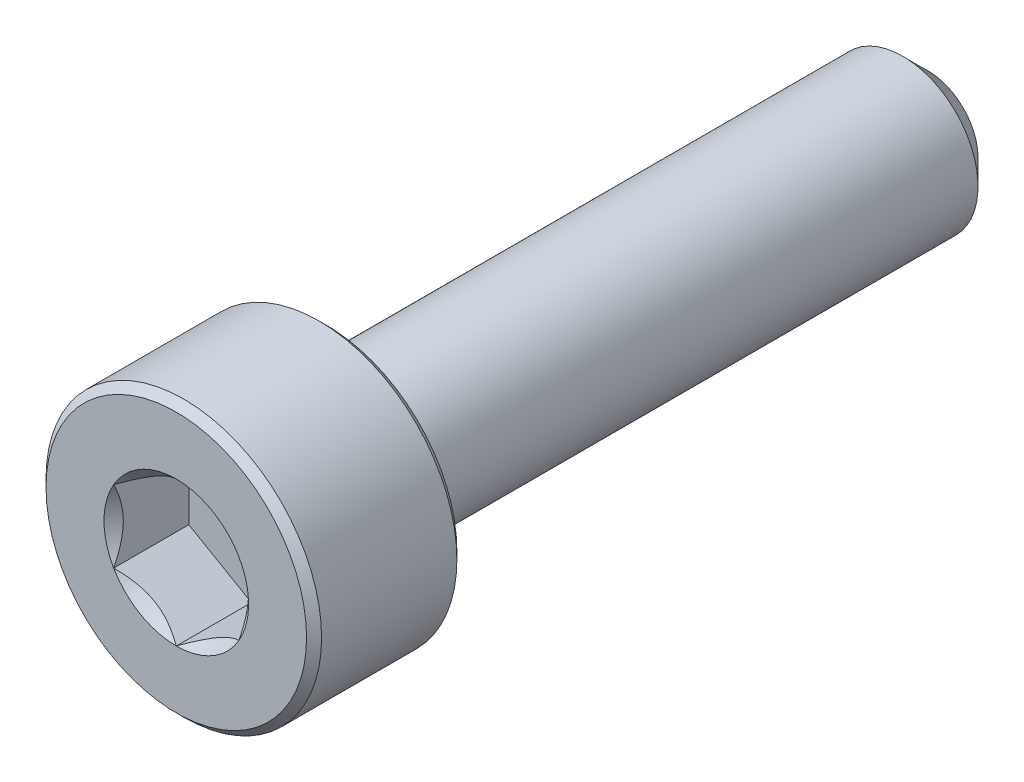
ISO-10303-21;
HEADER;
FILE_DESCRIPTION(('STEP AP214'),'2;1');
FILE_NAME('part.step','',(''),(''),'','','');
FILE_SCHEMA(('AUTOMOTIVE_DESIGN { 1 0 10303 214 1 1 1 1 }'));
ENDSEC;
DATA;
#1=APPLICATION_CONTEXT('core data for automotive mechanical design processes');
#2=APPLICATION_PROTOCOL_DEFINITION('international standard','automotive_design',2000,#1);
#3=PRODUCT_CONTEXT('',#1,'mechanical');
#4=PRODUCT('Part','Part','',(#3));
#5=PRODUCT_RELATED_PRODUCT_CATEGORY('part','',(#4));
#6=PRODUCT_DEFINITION_FORMATION('','',#4);
#7=PRODUCT_DEFINITION_CONTEXT('part definition',#1,'design');
#8=PRODUCT_DEFINITION('design','',#6,#7);
#9=PRODUCT_DEFINITION_SHAPE('','',#8);
#10=(LENGTH_UNIT() NAMED_UNIT(*) SI_UNIT(.MILLI.,.METRE.));
#11=(NAMED_UNIT(*) PLANE_ANGLE_UNIT() SI_UNIT($,.RADIAN.));
#12=(NAMED_UNIT(*) SI_UNIT($,.STERADIAN.) SOLID_ANGLE_UNIT());
#13=UNCERTAINTY_MEASURE_WITH_UNIT(LENGTH_MEASURE(1.E-05),#10,'distance_accuracy_value','');
#14=(GEOMETRIC_REPRESENTATION_CONTEXT(3) GLOBAL_UNCERTAINTY_ASSIGNED_CONTEXT((#13)) GLOBAL_UNIT_ASSIGNED_CONTEXT((#10,
#11,#12)) REPRESENTATION_CONTEXT('',''));
#15=CARTESIAN_POINT('',(0.,0.,0.));
#16=DIRECTION('',(0.,0.,1.));
#17=DIRECTION('',(1.,0.,0.));
#18=AXIS2_PLACEMENT_3D('',#15,#16,#17);
#19=CARTESIAN_POINT('',(0.,2.6,7.5));
#20=DIRECTION('',(0.,0.,1.));
#21=DIRECTION('',(1.,0.,0.));
#22=AXIS2_PLACEMENT_3D('',#19,#20,#21);
#23=PLANE('',#22);
#24=CARTESIAN_POINT('',(0.,0.,7.5));
#25=DIRECTION('',(0.,0.,1.));
#26=DIRECTION('',(1.,0.,0.));
#27=AXIS2_PLACEMENT_3D('',#24,#25,#26);
#28=CIRCLE('',#27,1.44337567297406);
#29=CARTESIAN_POINT('',(1.25,0.721687836487032,7.5));
#30=VERTEX_POINT('',#29);
#31=CARTESIAN_POINT('',(0.,1.44337567297406,7.5));
#32=VERTEX_POINT('',#31);
#33=EDGE_CURVE('E92',#30,#32,#28,.T.);
#34=ORIENTED_EDGE('',*,*,#33,.F.);
#35=CARTESIAN_POINT('',(1.25,-0.721687836487033,7.5));
#36=VERTEX_POINT('',#35);
#37=EDGE_CURVE('E52',#36,#30,#28,.T.);
#38=ORIENTED_EDGE('',*,*,#37,.F.);
#39=CARTESIAN_POINT('',(0.,-1.44337567297406,7.5));
#40=VERTEX_POINT('',#39);
#41=EDGE_CURVE('E278',#40,#36,#28,.T.);
#42=ORIENTED_EDGE('',*,*,#41,.F.);
#43=CARTESIAN_POINT('',(-1.25,-0.72168783648703,7.5));
#44=VERTEX_POINT('',#43);
#45=EDGE_CURVE('E59',#44,#40,#28,.T.);
#46=ORIENTED_EDGE('',*,*,#45,.F.);
#47=CARTESIAN_POINT('',(-1.25,0.721687836487034,7.5));
#48=VERTEX_POINT('',#47);
#49=EDGE_CURVE('E128',#48,#44,#28,.T.);
#50=ORIENTED_EDGE('',*,*,#49,.F.);
#51=EDGE_CURVE('E101',#32,#48,#28,.T.);
#52=ORIENTED_EDGE('',*,*,#51,.F.);
#53=EDGE_LOOP('',(#34,#38,#42,#46,#50,#52));
#54=FACE_BOUND('',#53,.T.);
#55=CARTESIAN_POINT('',(0.,0.,7.5));
#56=DIRECTION('',(0.,0.,-1.));
#57=DIRECTION('',(-1.,0.,0.));
#58=AXIS2_PLACEMENT_3D('',#55,#56,#57);
#59=CIRCLE('',#58,2.6);
#60=CARTESIAN_POINT('',(-2.6,0.,7.5));
#61=VERTEX_POINT('',#60);
#62=EDGE_CURVE('E46',#61,#61,#59,.T.);
#63=ORIENTED_EDGE('',*,*,#62,.F.);
#64=EDGE_LOOP('',(#63));
#65=FACE_BOUND('',#64,.T.);
#66=ADVANCED_FACE('F33',(#54,#65),#23,.T.);
#67=CARTESIAN_POINT('',(0.,0.,7.35));
#68=DIRECTION('',(0.,0.,-1.));
#69=DIRECTION('',(-1.,0.,0.));
#70=AXIS2_PLACEMENT_3D('',#67,#68,#69);
#71=CONICAL_SURFACE('',#70,2.75,0.785398163397448);
#72=ORIENTED_EDGE('',*,*,#62,.T.);
#73=EDGE_LOOP('',(#72));
#74=FACE_BOUND('',#73,.T.);
#75=CARTESIAN_POINT('',(0.,0.,7.35));
#76=DIRECTION('',(0.,0.,-1.));
#77=DIRECTION('',(-1.,0.,0.));
#78=AXIS2_PLACEMENT_3D('',#75,#76,#77);
#79=CIRCLE('',#78,2.75);
#80=CARTESIAN_POINT('',(-2.75,0.,7.35));
#81=VERTEX_POINT('',#80);
#82=EDGE_CURVE('E212',#81,#81,#79,.T.);
#83=ORIENTED_EDGE('',*,*,#82,.F.);
#84=EDGE_LOOP('',(#83));
#85=FACE_BOUND('',#84,.T.);
#86=ADVANCED_FACE('F217',(#74,#85),#71,.T.);
#87=CARTESIAN_POINT('',(0.,0.,-7.5));
#88=DIRECTION('',(0.,0.,-1.));
#89=DIRECTION('',(-1.,0.,0.));
#90=AXIS2_PLACEMENT_3D('',#87,#88,#89);
#91=CYLINDRICAL_SURFACE('',#90,2.75);
#92=ORIENTED_EDGE('',*,*,#82,.T.);
#93=EDGE_LOOP('',(#92));
#94=FACE_BOUND('',#93,.T.);
#95=CARTESIAN_POINT('',(0.,0.,4.65));
#96=DIRECTION('',(0.,0.,-1.));
#97=DIRECTION('',(-1.,0.,0.));
#98=AXIS2_PLACEMENT_3D('',#95,#96,#97);
#99=CIRCLE('',#98,2.75);
#100=CARTESIAN_POINT('',(-2.75,0.,4.65));
#101=VERTEX_POINT('',#100);
#102=EDGE_CURVE('E209',#101,#101,#99,.T.);
#103=ORIENTED_EDGE('',*,*,#102,.F.);
#104=EDGE_LOOP('',(#103));
#105=FACE_BOUND('',#104,.T.);
#106=ADVANCED_FACE('F223',(#94,#105),#91,.T.);
#107=CARTESIAN_POINT('',(0.,0.,4.5));
#108=DIRECTION('',(0.,0.,1.));
#109=DIRECTION('',(1.,0.,0.));
#110=AXIS2_PLACEMENT_3D('',#107,#108,#109);
#111=CONICAL_SURFACE('',#110,2.6,0.785398163397448);
#112=ORIENTED_EDGE('',*,*,#102,.T.);
#113=EDGE_LOOP('',(#112));
#114=FACE_BOUND('',#113,.T.);
#115=CARTESIAN_POINT('',(0.,0.,4.5));
#116=DIRECTION('',(0.,0.,-1.));
#117=DIRECTION('',(-1.,0.,0.));
#118=AXIS2_PLACEMENT_3D('',#115,#116,#117);
#119=CIRCLE('',#118,2.6);
#120=CARTESIAN_POINT('',(-2.6,0.,4.5));
#121=VERTEX_POINT('',#120);
#122=EDGE_CURVE('E206',#121,#121,#119,.T.);
#123=ORIENTED_EDGE('',*,*,#122,.F.);
#124=EDGE_LOOP('',(#123));
#125=FACE_BOUND('',#124,.T.);
#126=ADVANCED_FACE('F227',(#114,#125),#111,.T.);
#127=CARTESIAN_POINT('',(0.,2.6,4.5));
#128=DIRECTION('',(0.,0.,-1.));
#129=DIRECTION('',(-1.,0.,0.));
#130=AXIS2_PLACEMENT_3D('',#127,#128,#129);
#131=PLANE('',#130);
#132=ORIENTED_EDGE('',*,*,#122,.T.);
#133=EDGE_LOOP('',(#132));
#134=FACE_BOUND('',#133,.T.);
#135=CARTESIAN_POINT('',(0.,0.,4.5));
#136=DIRECTION('',(0.,0.,-1.));
#137=DIRECTION('',(-1.,0.,0.));
#138=AXIS2_PLACEMENT_3D('',#135,#136,#137);
#139=CIRCLE('',#138,1.5);
#140=CARTESIAN_POINT('',(-1.5,0.,4.5));
#141=VERTEX_POINT('',#140);
#142=EDGE_CURVE('E203',#141,#141,#139,.T.);
#143=ORIENTED_EDGE('',*,*,#142,.F.);
#144=EDGE_LOOP('',(#143));
#145=FACE_BOUND('',#144,.T.);
#146=ADVANCED_FACE('F233',(#134,#145),#131,.T.);
#147=CARTESIAN_POINT('',(0.,0.,-7.5));
#148=DIRECTION('',(0.,0.,-1.));
#149=DIRECTION('',(-1.,0.,0.));
#150=AXIS2_PLACEMENT_3D('',#147,#148,#149);
#151=CYLINDRICAL_SURFACE('',#150,1.5);
#152=ORIENTED_EDGE('',*,*,#142,.T.);
#153=EDGE_LOOP('',(#152));
#154=FACE_BOUND('',#153,.T.);
#155=CARTESIAN_POINT('',(0.,0.,-7.));
#156=DIRECTION('',(0.,0.,-1.));
#157=DIRECTION('',(-1.,0.,0.));
#158=AXIS2_PLACEMENT_3D('',#155,#156,#157);
#159=CIRCLE('',#158,1.5);
#160=CARTESIAN_POINT('',(-1.5,0.,-7.));
#161=VERTEX_POINT('',#160);
#162=EDGE_CURVE('E200',#161,#161,#159,.T.);
#163=ORIENTED_EDGE('',*,*,#162,.F.);
#164=EDGE_LOOP('',(#163));
#165=FACE_BOUND('',#164,.T.);
#166=ADVANCED_FACE('F237',(#154,#165),#151,.T.);
#167=CARTESIAN_POINT('',(0.,0.,-7.5));
#168=DIRECTION('',(0.,0.,1.));
#169=DIRECTION('',(1.,0.,0.));
#170=AXIS2_PLACEMENT_3D('',#167,#168,#169);
#171=CONICAL_SURFACE('',#170,1.,0.785398163397445);
#172=ORIENTED_EDGE('',*,*,#162,.T.);
#173=EDGE_LOOP('',(#172));
#174=FACE_BOUND('',#173,.T.);
#175=CARTESIAN_POINT('',(0.,0.,-7.5));
#176=DIRECTION('',(0.,0.,-1.));
#177=DIRECTION('',(-1.,0.,0.));
#178=AXIS2_PLACEMENT_3D('',#175,#176,#177);
#179=CIRCLE('',#178,1.);
#180=CARTESIAN_POINT('',(-1.,0.,-7.5));
#181=VERTEX_POINT('',#180);
#182=EDGE_CURVE('E188',#181,#181,#179,.T.);
#183=ORIENTED_EDGE('',*,*,#182,.F.);
#184=EDGE_LOOP('',(#183));
#185=FACE_BOUND('',#184,.T.);
#186=ADVANCED_FACE('F240',(#174,#185),#171,.T.);
#187=CARTESIAN_POINT('',(0.,1.,-7.5));
#188=DIRECTION('',(0.,0.,-1.));
#189=DIRECTION('',(-1.,0.,0.));
#190=AXIS2_PLACEMENT_3D('',#187,#188,#189);
#191=PLANE('',#190);
#192=ORIENTED_EDGE('',*,*,#182,.T.);
#193=EDGE_LOOP('',(#192));
#194=FACE_BOUND('',#193,.T.);
#195=ADVANCED_FACE('F161',(#194),#191,.T.);
#196=CARTESIAN_POINT('',(0.,0.,7.5));
#197=DIRECTION('',(0.,0.,1.));
#198=DIRECTION('',(1.,0.,0.));
#199=AXIS2_PLACEMENT_3D('',#196,#197,#198);
#200=CONICAL_SURFACE('',#199,1.44337567297406,0.78539816339745);
#201=ORIENTED_EDGE('',*,*,#51,.T.);
#202=CARTESIAN_POINT('',(0.000199999999999744,1.4434911430279,7.50011548390914));
#203=CARTESIAN_POINT('',(-0.0427751670715871,1.41867941875065,7.47532166805511));
#204=CARTESIAN_POINT('',(-0.0864690047459485,1.39345276980743,7.45198373441869));
#205=CARTESIAN_POINT('',(-0.175565930841942,1.34201263554194,7.40925200408454));
#206=CARTESIAN_POINT('',(-0.220977498357065,1.31579425481276,7.38988199236042));
#207=CARTESIAN_POINT('',(-0.31254782093526,1.26292610442246,7.35670048341348));
#208=CARTESIAN_POINT('',(-0.358683240175886,1.23628980770471,7.34280555905266));
#209=CARTESIAN_POINT('',(-0.451970080407593,1.18243062538508,7.32139728216064));
#210=CARTESIAN_POINT('',(-0.49911864913638,1.15520938653761,7.31386794156679));
#211=CARTESIAN_POINT('',(-0.580373556887253,1.10829684367467,7.3070744980507));
#212=CARTESIAN_POINT('',(-0.614374876627941,1.08866617256958,7.30606855910435));
#213=CARTESIAN_POINT('',(-0.682317764432478,1.04943932800611,7.30776141491132));
#214=CARTESIAN_POINT('',(-0.716259317655658,1.02984316311599,7.31046102721554));
#215=CARTESIAN_POINT('',(-0.7838148564575,0.990839954603499,7.31940893031638));
#216=CARTESIAN_POINT('',(-0.817428507286775,0.971433104248771,7.32566052589971));
#217=CARTESIAN_POINT('',(-0.884094638217814,0.932943395609905,7.34137568141391));
#218=CARTESIAN_POINT('',(-0.917146871030296,0.9138606800983,7.35084062008746));
#219=CARTESIAN_POINT('',(-1.00179969160026,0.864986351354568,7.37893139068759));
#220=CARTESIAN_POINT('',(-1.05286649242964,0.835502920149076,7.3996701574522));
#221=CARTESIAN_POINT('',(-1.15300085411325,0.777690319475909,7.44638713467148));
#222=CARTESIAN_POINT('',(-1.20207431157827,0.749357745598417,7.47234829594677));
#223=CARTESIAN_POINT('',(-1.2502,0.721572366433195,7.50011548390914));
#224=B_SPLINE_CURVE_WITH_KNOTS('',3,(#202,#203,#204,#205,#206,#207,#208,#209,#210,#211,#212,
#213,#214,#215,#216,#217,#218,#219,#220,#221,#222,#223),.UNSPECIFIED.,.F.,.F.,(4,2,2,2,2,2,2,2,
2,2,4),(0.,0.166533409618304,0.334037607289762,0.498880396489699,0.663307919240275,
0.780963963458827,0.898645970148453,1.01643764860773,1.1342799317155,1.32148652032141,
1.50809158792574),.UNSPECIFIED.);
#225=EDGE_CURVE('E11',#32,#48,#224,.T.);
#226=ORIENTED_EDGE('',*,*,#225,.F.);
#227=EDGE_LOOP('',(#201,#226));
#228=FACE_BOUND('',#227,.T.);
#229=ADVANCED_FACE('F105',(#228),#200,.F.);
#230=ORIENTED_EDGE('',*,*,#49,.T.);
#231=CARTESIAN_POINT('',(-1.25,-1.38510182026142,7.92237003651893));
#232=CARTESIAN_POINT('',(-1.25,-1.35111986791654,7.89714624624165));
#233=CARTESIAN_POINT('',(-1.25,-1.31694282798165,7.8721859570987));
#234=CARTESIAN_POINT('',(-1.25,-1.24812142703778,7.82289946459782));
#235=CARTESIAN_POINT('',(-1.25,-1.21347694519278,7.79857343015524));
#236=CARTESIAN_POINT('',(-1.25,-1.10822083307585,7.72636172374247));
#237=CARTESIAN_POINT('',(-1.25,-1.03680313809814,7.67963105654718));
#238=CARTESIAN_POINT('',(-1.25,-0.887382774503049,7.58837288422405));
#239=CARTESIAN_POINT('',(-1.25,-0.809230860354648,7.54408680062095));
#240=CARTESIAN_POINT('',(-1.25,-0.649095969627881,7.46341771993846));
#241=CARTESIAN_POINT('',(-1.25,-0.567127025778808,7.42700818374294));
#242=CARTESIAN_POINT('',(-1.25,-0.443557329507033,7.38248253765294));
#243=CARTESIAN_POINT('',(-1.25,-0.403672751512107,7.36961750891589));
#244=CARTESIAN_POINT('',(-1.25,-0.322988211982144,7.34709732599784));
#245=CARTESIAN_POINT('',(-1.25,-0.282188183066514,7.33744240892579));
#246=CARTESIAN_POINT('',(-1.25,-0.200572985420666,7.32199119638416));
#247=CARTESIAN_POINT('',(-1.25,-0.159769911896366,7.31613197737595));
#248=CARTESIAN_POINT('',(-1.25,-0.0777868304089239,7.30837795446847));
#249=CARTESIAN_POINT('',(-1.25,-0.0366068784025135,7.30648257133364));
#250=CARTESIAN_POINT('',(-1.25,0.0444682995491155,7.30677812945619));
#251=CARTESIAN_POINT('',(-1.25,0.084364037822944,7.30884503442731));
#252=CARTESIAN_POINT('',(-1.25,0.163790547253528,7.31668957022574));
#253=CARTESIAN_POINT('',(-1.25,0.203321243504862,7.3224679461945));
#254=CARTESIAN_POINT('',(-1.25,0.282393986569087,7.33752741684666));
#255=CARTESIAN_POINT('',(-1.25,0.321924894821446,7.34686615693867));
#256=CARTESIAN_POINT('',(-1.25,0.400129025325507,7.36856655334425));
#257=CARTESIAN_POINT('',(-1.25,0.438802336675167,7.380927894012));
#258=CARTESIAN_POINT('',(-1.25,0.563172796674043,7.42526147457396));
#259=CARTESIAN_POINT('',(-1.25,0.647028633361639,7.46238856081833));
#260=CARTESIAN_POINT('',(-1.25,0.810774511829943,7.54485212067595));
#261=CARTESIAN_POINT('',(-1.25,0.890648632035888,7.59021863392705));
#262=CARTESIAN_POINT('',(-1.25,1.04325497137231,7.68372167893417));
#263=CARTESIAN_POINT('',(-1.25,1.11614441495489,7.73160472191527));
#264=CARTESIAN_POINT('',(-1.25,1.22353402780521,7.80558839420389));
#265=CARTESIAN_POINT('',(-1.25,1.25886567990417,7.83050307314204));
#266=CARTESIAN_POINT('',(-1.25,1.32904842299966,7.88098117650382));
#267=CARTESIAN_POINT('',(-1.25,1.36389964210964,7.90654442260414));
#268=CARTESIAN_POINT('',(-1.25,1.39855118205095,7.93237628525925));
#269=B_SPLINE_CURVE_WITH_KNOTS('',3,(#231,#232,#233,#234,#235,#236,#237,#238,#239,#240,#241,
#242,#243,#244,#245,#246,#247,#248,#249,#250,#251,#252,#253,#254,#255,#256,#257,#258,#259,#260,
#261,#262,#263,#264,#265,#266,#267,#268),.UNSPECIFIED.,.F.,.F.,(4,2,2,2,2,2,2,2,2,2,2,2,2,2,2,2,
2,2,4),(0.,0.126957685892468,0.253948844888988,0.509869208273041,0.779115443569668,
1.04743984536898,1.17305649245659,1.29868241592515,1.42216852630225,1.5456365903859,
1.6653025991614,1.78499264045314,1.90670905612004,2.02841276654157,2.30272027119573,
2.57804870101489,2.83955156876987,2.96924486861395,3.09890288771825),.UNSPECIFIED.);
#270=EDGE_CURVE('E100',#48,#44,#269,.F.);
#271=ORIENTED_EDGE('',*,*,#270,.F.);
#272=EDGE_LOOP('',(#230,#271));
#273=FACE_BOUND('',#272,.T.);
#274=ADVANCED_FACE('F255',(#273),#200,.F.);
#275=ORIENTED_EDGE('',*,*,#45,.T.);
#276=CARTESIAN_POINT('',(-1.2502,-0.721572366433195,7.50011548390914));
#277=CARTESIAN_POINT('',(-1.20722483292841,-0.746384090710444,7.47532166805511));
#278=CARTESIAN_POINT('',(-1.16353099525405,-0.771610739653665,7.45198373441869));
#279=CARTESIAN_POINT('',(-1.07443406915806,-0.823050873919155,7.40925200408454));
#280=CARTESIAN_POINT('',(-1.02902250164294,-0.849269254648334,7.38988199236042));
#281=CARTESIAN_POINT('',(-0.93745217906474,-0.902137405038636,7.35670048341348));
#282=CARTESIAN_POINT('',(-0.891316759824114,-0.928773701756388,7.34280555905266));
#283=CARTESIAN_POINT('',(-0.798029919592407,-0.982632884076013,7.32139728216064));
#284=CARTESIAN_POINT('',(-0.75088135086362,-1.00985412292348,7.31386794156679));
#285=CARTESIAN_POINT('',(-0.669626443112747,-1.05676666578643,7.3070744980507));
#286=CARTESIAN_POINT('',(-0.635625123372059,-1.07639733689152,7.30606855910435));
#287=CARTESIAN_POINT('',(-0.567682235567522,-1.11562418145499,7.30776141491132));
#288=CARTESIAN_POINT('',(-0.533740682344342,-1.1352203463451,7.31046102721554));
#289=CARTESIAN_POINT('',(-0.4661851435425,-1.1742235548576,7.31940893031638));
#290=CARTESIAN_POINT('',(-0.432571492713225,-1.19363040521233,7.32566052589971));
#291=CARTESIAN_POINT('',(-0.365905361782187,-1.23212011385119,7.34137568141391));
#292=CARTESIAN_POINT('',(-0.332853128969704,-1.2512028293628,7.35084062008746));
#293=CARTESIAN_POINT('',(-0.248200308399735,-1.30007715810653,7.37893139068759));
#294=CARTESIAN_POINT('',(-0.197133507570362,-1.32956058931202,7.3996701574522));
#295=CARTESIAN_POINT('',(-0.0969991458867457,-1.38737318998519,7.44638713467148));
#296=CARTESIAN_POINT('',(-0.047925688421731,-1.41570576386268,7.47234829594677));
#297=CARTESIAN_POINT('',(0.000199999999999764,-1.4434911430279,7.50011548390914));
#298=B_SPLINE_CURVE_WITH_KNOTS('',3,(#276,#277,#278,#279,#280,#281,#282,#283,#284,#285,#286,
#287,#288,#289,#290,#291,#292,#293,#294,#295,#296,#297),.UNSPECIFIED.,.F.,.F.,(4,2,2,2,2,2,2,2,
2,2,4),(0.,0.166533409618304,0.334037607289762,0.498880396489699,0.663307919240275,
0.780963963458827,0.898645970148454,1.01643764860773,1.1342799317155,1.32148652032141,
1.50809158792574),.UNSPECIFIED.);
#299=EDGE_CURVE('E137',#44,#40,#298,.T.);
#300=ORIENTED_EDGE('',*,*,#299,.F.);
#301=EDGE_LOOP('',(#275,#300));
#302=FACE_BOUND('',#301,.T.);
#303=ADVANCED_FACE('F259',(#302),#200,.F.);
#304=ORIENTED_EDGE('',*,*,#41,.T.);
#305=CARTESIAN_POINT('',(-0.000200000000000316,-1.4434911430279,7.50011548390914));
#306=CARTESIAN_POINT('',(0.0427751670715865,-1.41867941875065,7.47532166805511));
#307=CARTESIAN_POINT('',(0.0864690047459477,-1.39345276980743,7.45198373441869));
#308=CARTESIAN_POINT('',(0.175565930841942,-1.34201263554194,7.40925200408454));
#309=CARTESIAN_POINT('',(0.220977498357064,-1.31579425481276,7.38988199236042));
#310=CARTESIAN_POINT('',(0.31254782093526,-1.26292610442246,7.35670048341348));
#311=CARTESIAN_POINT('',(0.358683240175885,-1.23628980770471,7.34280555905266));
#312=CARTESIAN_POINT('',(0.451970080407592,-1.18243062538508,7.32139728216064));
#313=CARTESIAN_POINT('',(0.49911864913638,-1.15520938653761,7.31386794156679));
#314=CARTESIAN_POINT('',(0.580373556887252,-1.10829684367467,7.3070744980507));
#315=CARTESIAN_POINT('',(0.614374876627941,-1.08866617256958,7.30606855910435));
#316=CARTESIAN_POINT('',(0.682317764432477,-1.04943932800611,7.30776141491132));
#317=CARTESIAN_POINT('',(0.716259317655657,-1.02984316311599,7.31046102721554));
#318=CARTESIAN_POINT('',(0.783814856457499,-0.9908399546035,7.31940893031638));
#319=CARTESIAN_POINT('',(0.817428507286775,-0.971433104248771,7.32566052589971));
#320=CARTESIAN_POINT('',(0.884094638217813,-0.932943395609906,7.34137568141391));
#321=CARTESIAN_POINT('',(0.917146871030295,-0.913860680098301,7.35084062008746));
#322=CARTESIAN_POINT('',(1.00179969160026,-0.864986351354568,7.37893139068759));
#323=CARTESIAN_POINT('',(1.05286649242964,-0.835502920149076,7.3996701574522));
#324=CARTESIAN_POINT('',(1.15300085411325,-0.777690319475909,7.44638713467148));
#325=CARTESIAN_POINT('',(1.20207431157827,-0.749357745598418,7.47234829594677));
#326=CARTESIAN_POINT('',(1.2502,-0.721572366433196,7.50011548390914));
#327=B_SPLINE_CURVE_WITH_KNOTS('',3,(#305,#306,#307,#308,#309,#310,#311,#312,#313,#314,#315,
#316,#317,#318,#319,#320,#321,#322,#323,#324,#325,#326),.UNSPECIFIED.,.F.,.F.,(4,2,2,2,2,2,2,2,
2,2,4),(0.,0.166533409618304,0.334037607289762,0.498880396489698,0.663307919240274,
0.780963963458827,0.898645970148453,1.01643764860773,1.1342799317155,1.32148652032141,
1.50809158792573),.UNSPECIFIED.);
#328=EDGE_CURVE('E280',#40,#36,#327,.T.);
#329=ORIENTED_EDGE('',*,*,#328,.F.);
#330=EDGE_LOOP('',(#304,#329));
#331=FACE_BOUND('',#330,.T.);
#332=ADVANCED_FACE('F268',(#331),#200,.F.);
#333=ORIENTED_EDGE('',*,*,#37,.T.);
#334=CARTESIAN_POINT('',(1.25,-1.38510181874983,7.92237003539674));
#335=CARTESIAN_POINT('',(1.25,-1.3511198664462,7.89714624516244));
#336=CARTESIAN_POINT('',(1.25,-1.31694282655271,7.87218595606241));
#337=CARTESIAN_POINT('',(1.25,-1.24812142569208,7.82289946364711));
#338=CARTESIAN_POINT('',(1.25,-1.21347694388892,7.7985734292472));
#339=CARTESIAN_POINT('',(1.25,-1.10822083190007,7.72636172296323));
#340=CARTESIAN_POINT('',(1.25,-1.03680313700951,7.67963105585343));
#341=CARTESIAN_POINT('',(1.25,-0.887382773604424,7.58837288370571));
#342=CARTESIAN_POINT('',(1.25,-0.809230859559388,7.54408680019188));
#343=CARTESIAN_POINT('',(1.25,-0.649095969048194,7.46341771967474));
#344=CARTESIAN_POINT('',(1.25,-0.567127025311258,7.42700818355541));
#345=CARTESIAN_POINT('',(1.25,-0.443557329124526,7.38248253752399));
#346=CARTESIAN_POINT('',(1.25,-0.403672751095207,7.36961750878661));
#347=CARTESIAN_POINT('',(1.25,-0.322988211495525,7.34709732587494));
#348=CARTESIAN_POINT('',(1.25,-0.28218818254457,7.3374424088096));
#349=CARTESIAN_POINT('',(1.25,-0.200572984829335,7.32199119628927));
#350=CARTESIAN_POINT('',(1.25,-0.159769911270982,7.31613197729548));
#351=CARTESIAN_POINT('',(1.25,-0.0777868297167933,7.30837795442431));
#352=CARTESIAN_POINT('',(1.25,-0.0366068776776873,7.30648257131138));
#353=CARTESIAN_POINT('',(1.25,0.0444683003388064,7.30677812948321));
#354=CARTESIAN_POINT('',(1.25,0.08436403864488,7.3088450344818));
#355=CARTESIAN_POINT('',(1.25,0.16379054813703,7.3166895703397));
#356=CARTESIAN_POINT('',(1.25,0.203321244417683,7.32246794634046));
#357=CARTESIAN_POINT('',(1.25,0.282393987539771,7.33752741705993));
#358=CARTESIAN_POINT('',(1.25,0.321924895820597,7.34686615718743));
#359=CARTESIAN_POINT('',(1.25,0.400129026379048,7.36856655366507));
#360=CARTESIAN_POINT('',(1.25,0.438802337754633,7.38092789436938));
#361=CARTESIAN_POINT('',(1.25,0.563172797994066,7.42526147510656));
#362=CARTESIAN_POINT('',(1.25,0.647028634884195,7.46238856151275));
#363=CARTESIAN_POINT('',(1.25,0.810774513742062,7.54485212171168));
#364=CARTESIAN_POINT('',(1.25,0.890648634134939,7.59021863514241));
#365=CARTESIAN_POINT('',(1.25,1.04325497380785,7.68372168049333));
#366=CARTESIAN_POINT('',(1.25,1.11614441754118,7.73160472363706));
#367=CARTESIAN_POINT('',(1.25,1.22353403061444,7.8055883961688));
#368=CARTESIAN_POINT('',(1.25,1.25886568278664,7.83050307518733));
#369=CARTESIAN_POINT('',(1.25,1.32904842602817,7.8809811787098));
#370=CARTESIAN_POINT('',(1.25,1.36389964521094,7.90654442489043));
#371=CARTESIAN_POINT('',(1.25,1.3985511852249,7.93237628762573));
#372=B_SPLINE_CURVE_WITH_KNOTS('',3,(#334,#335,#336,#337,#338,#339,#340,#341,#342,#343,#344,
#345,#346,#347,#348,#349,#350,#351,#352,#353,#354,#355,#356,#357,#358,#359,#360,#361,#362,#363,
#364,#365,#366,#367,#368,#369,#370,#371),.UNSPECIFIED.,.F.,.F.,(4,2,2,2,2,2,2,2,2,2,2,2,2,2,2,2,
2,2,4),(0.,0.126957685716233,0.253948844536467,0.509869207561398,0.779115442456379,
1.04743984385779,1.17305649104354,1.29868241461005,1.42216852508157,1.54563658925965,
1.66530259813563,1.78499263952808,1.9067090553025,2.02841276583151,2.30272027123448,
2.57804870180744,2.83955157020837,2.96924487037104,3.0989028897939),.UNSPECIFIED.);
#373=EDGE_CURVE('E117',#36,#30,#372,.T.);
#374=ORIENTED_EDGE('',*,*,#373,.F.);
#375=EDGE_LOOP('',(#333,#374));
#376=FACE_BOUND('',#375,.T.);
#377=ADVANCED_FACE('F262',(#376),#200,.F.);
#378=ORIENTED_EDGE('',*,*,#33,.T.);
#379=CARTESIAN_POINT('',(1.2502,0.721572366433195,7.50011548390914));
#380=CARTESIAN_POINT('',(1.20722483292841,0.746384090710444,7.47532166805511));
#381=CARTESIAN_POINT('',(1.16353099525405,0.771610739653664,7.45198373441868));
#382=CARTESIAN_POINT('',(1.07443406915806,0.823050873919155,7.40925200408454));
#383=CARTESIAN_POINT('',(1.02902250164294,0.849269254648333,7.38988199236042));
#384=CARTESIAN_POINT('',(0.93745217906474,0.902137405038636,7.35670048341348));
#385=CARTESIAN_POINT('',(0.891316759824114,0.928773701756387,7.34280555905266));
#386=CARTESIAN_POINT('',(0.798029919592407,0.982632884076013,7.32139728216064));
#387=CARTESIAN_POINT('',(0.75088135086362,1.00985412292348,7.31386794156679));
#388=CARTESIAN_POINT('',(0.669626443112747,1.05676666578643,7.3070744980507));
#389=CARTESIAN_POINT('',(0.635625123372059,1.07639733689152,7.30606855910435));
#390=CARTESIAN_POINT('',(0.567682235567522,1.11562418145499,7.30776141491132));
#391=CARTESIAN_POINT('',(0.533740682344342,1.1352203463451,7.31046102721554));
#392=CARTESIAN_POINT('',(0.4661851435425,1.1742235548576,7.31940893031638));
#393=CARTESIAN_POINT('',(0.432571492713225,1.19363040521233,7.32566052589971));
#394=CARTESIAN_POINT('',(0.365905361782187,1.23212011385119,7.34137568141391));
#395=CARTESIAN_POINT('',(0.332853128969704,1.2512028293628,7.35084062008746));
#396=CARTESIAN_POINT('',(0.248200308399736,1.30007715810653,7.37893139068759));
#397=CARTESIAN_POINT('',(0.197133507570362,1.32956058931202,7.3996701574522));
#398=CARTESIAN_POINT('',(0.0969991458867451,1.38737318998519,7.44638713467148));
#399=CARTESIAN_POINT('',(0.0479256884217304,1.41570576386268,7.47234829594677));
#400=CARTESIAN_POINT('',(-0.000200000000000211,1.4434911430279,7.50011548390914));
#401=B_SPLINE_CURVE_WITH_KNOTS('',3,(#379,#380,#381,#382,#383,#384,#385,#386,#387,#388,#389,
#390,#391,#392,#393,#394,#395,#396,#397,#398,#399,#400),.UNSPECIFIED.,.F.,.F.,(4,2,2,2,2,2,2,2,
2,2,4),(0.,0.166533409618303,0.334037607289761,0.498880396489698,0.663307919240274,
0.780963963458826,0.898645970148452,1.01643764860773,1.13427993171549,1.32148652032141,
1.50809158792573),.UNSPECIFIED.);
#402=EDGE_CURVE('E96',#30,#32,#401,.T.);
#403=ORIENTED_EDGE('',*,*,#402,.F.);
#404=EDGE_LOOP('',(#378,#403));
#405=FACE_BOUND('',#404,.T.);
#406=ADVANCED_FACE('F94',(#405),#200,.F.);
#407=CARTESIAN_POINT('',(0.,0.,6.));
#408=DIRECTION('',(0.,0.,1.));
#409=DIRECTION('',(1.,0.,0.));
#410=AXIS2_PLACEMENT_3D('',#407,#408,#409);
#411=PLANE('',#410);
#412=DIRECTION('',(-0.866025403784439,0.5,0.));
#413=VECTOR('',#412,1.);
#414=CARTESIAN_POINT('',(1.25,0.721687836487033,6.));
#415=LINE('',#414,#413);
#416=CARTESIAN_POINT('',(1.25,0.721687836487033,6.));
#417=VERTEX_POINT('',#416);
#418=CARTESIAN_POINT('',(0.,1.44337567297406,6.));
#419=VERTEX_POINT('',#418);
#420=EDGE_CURVE('E116',#417,#419,#415,.T.);
#421=ORIENTED_EDGE('',*,*,#420,.T.);
#422=DIRECTION('',(-0.866025403784439,-0.5,0.));
#423=VECTOR('',#422,1.);
#424=CARTESIAN_POINT('',(0.,1.44337567297406,6.));
#425=LINE('',#424,#423);
#426=CARTESIAN_POINT('',(-1.25,0.721687836487033,6.));
#427=VERTEX_POINT('',#426);
#428=EDGE_CURVE('E121',#419,#427,#425,.T.);
#429=ORIENTED_EDGE('',*,*,#428,.T.);
#430=DIRECTION('',(0.,-1.,0.));
#431=VECTOR('',#430,1.);
#432=CARTESIAN_POINT('',(-1.25,0.721687836487033,6.));
#433=LINE('',#432,#431);
#434=CARTESIAN_POINT('',(-1.25,-0.721687836487032,6.));
#435=VERTEX_POINT('',#434);
#436=EDGE_CURVE('E176',#427,#435,#433,.T.);
#437=ORIENTED_EDGE('',*,*,#436,.T.);
#438=DIRECTION('',(0.866025403784439,-0.5,0.));
#439=VECTOR('',#438,1.);
#440=CARTESIAN_POINT('',(-1.25,-0.721687836487032,6.));
#441=LINE('',#440,#439);
#442=CARTESIAN_POINT('',(0.,-1.44337567297406,6.));
#443=VERTEX_POINT('',#442);
#444=EDGE_CURVE('E179',#435,#443,#441,.T.);
#445=ORIENTED_EDGE('',*,*,#444,.T.);
#446=DIRECTION('',(0.866025403784439,0.5,0.));
#447=VECTOR('',#446,1.);
#448=CARTESIAN_POINT('',(0.,-1.44337567297406,6.));
#449=LINE('',#448,#447);
#450=CARTESIAN_POINT('',(1.25,-0.721687836487033,6.));
#451=VERTEX_POINT('',#450);
#452=EDGE_CURVE('E182',#443,#451,#449,.T.);
#453=ORIENTED_EDGE('',*,*,#452,.T.);
#454=DIRECTION('',(0.,1.,0.));
#455=VECTOR('',#454,1.);
#456=CARTESIAN_POINT('',(1.25,-0.721687836487033,6.));
#457=LINE('',#456,#455);
#458=EDGE_CURVE('E124',#451,#417,#457,.T.);
#459=ORIENTED_EDGE('',*,*,#458,.T.);
#460=EDGE_LOOP('',(#421,#429,#437,#445,#453,#459));
#461=FACE_BOUND('',#460,.T.);
#462=ADVANCED_FACE('F156',(#461),#411,.T.);
#463=CARTESIAN_POINT('',(0.,1.44337567297406,6.));
#464=DIRECTION('',(-0.5,0.866025403784439,0.));
#465=DIRECTION('',(-0.866025403784439,-0.5,0.));
#466=AXIS2_PLACEMENT_3D('',#463,#464,#465);
#467=PLANE('',#466);
#468=DIRECTION('',(0.,0.,1.));
#469=VECTOR('',#468,1.);
#470=CARTESIAN_POINT('',(0.,1.44337567297406,6.));
#471=LINE('',#470,#469);
#472=EDGE_CURVE('E113',#419,#32,#471,.T.);
#473=ORIENTED_EDGE('',*,*,#472,.T.);
#474=ORIENTED_EDGE('',*,*,#225,.T.);
#475=DIRECTION('',(0.,0.,1.));
#476=VECTOR('',#475,1.);
#477=CARTESIAN_POINT('',(-1.25,0.721687836487033,6.));
#478=LINE('',#477,#476);
#479=EDGE_CURVE('E123',#427,#48,#478,.T.);
#480=ORIENTED_EDGE('',*,*,#479,.F.);
#481=ORIENTED_EDGE('',*,*,#428,.F.);
#482=EDGE_LOOP('',(#473,#474,#480,#481));
#483=FACE_BOUND('',#482,.T.);
#484=ADVANCED_FACE('F119',(#483),#467,.F.);
#485=CARTESIAN_POINT('',(-1.25,0.721687836487033,6.));
#486=DIRECTION('',(-1.,0.,0.));
#487=DIRECTION('',(0.,-1.,0.));
#488=AXIS2_PLACEMENT_3D('',#485,#486,#487);
#489=PLANE('',#488);
#490=ORIENTED_EDGE('',*,*,#479,.T.);
#491=ORIENTED_EDGE('',*,*,#270,.T.);
#492=DIRECTION('',(0.,0.,1.));
#493=VECTOR('',#492,1.);
#494=CARTESIAN_POINT('',(-1.25,-0.721687836487032,6.));
#495=LINE('',#494,#493);
#496=EDGE_CURVE('E194',#435,#44,#495,.T.);
#497=ORIENTED_EDGE('',*,*,#496,.F.);
#498=ORIENTED_EDGE('',*,*,#436,.F.);
#499=EDGE_LOOP('',(#490,#491,#497,#498));
#500=FACE_BOUND('',#499,.T.);
#501=ADVANCED_FACE('F146',(#500),#489,.F.);
#502=CARTESIAN_POINT('',(-1.25,-0.721687836487032,6.));
#503=DIRECTION('',(-0.5,-0.866025403784439,0.));
#504=DIRECTION('',(0.866025403784439,-0.5,0.));
#505=AXIS2_PLACEMENT_3D('',#502,#503,#504);
#506=PLANE('',#505);
#507=ORIENTED_EDGE('',*,*,#496,.T.);
#508=ORIENTED_EDGE('',*,*,#299,.T.);
#509=DIRECTION('',(0.,0.,1.));
#510=VECTOR('',#509,1.);
#511=CARTESIAN_POINT('',(0.,-1.44337567297406,6.));
#512=LINE('',#511,#510);
#513=EDGE_CURVE('E191',#443,#40,#512,.T.);
#514=ORIENTED_EDGE('',*,*,#513,.F.);
#515=ORIENTED_EDGE('',*,*,#444,.F.);
#516=EDGE_LOOP('',(#507,#508,#514,#515));
#517=FACE_BOUND('',#516,.T.);
#518=ADVANCED_FACE('F149',(#517),#506,.F.);
#519=CARTESIAN_POINT('',(0.,-1.44337567297406,6.));
#520=DIRECTION('',(0.5,-0.866025403784439,0.));
#521=DIRECTION('',(0.866025403784439,0.5,0.));
#522=AXIS2_PLACEMENT_3D('',#519,#520,#521);
#523=PLANE('',#522);
#524=ORIENTED_EDGE('',*,*,#513,.T.);
#525=ORIENTED_EDGE('',*,*,#328,.T.);
#526=DIRECTION('',(0.,0.,1.));
#527=VECTOR('',#526,1.);
#528=CARTESIAN_POINT('',(1.25,-0.721687836487033,6.));
#529=LINE('',#528,#527);
#530=EDGE_CURVE('E189',#451,#36,#529,.T.);
#531=ORIENTED_EDGE('',*,*,#530,.F.);
#532=ORIENTED_EDGE('',*,*,#452,.F.);
#533=EDGE_LOOP('',(#524,#525,#531,#532));
#534=FACE_BOUND('',#533,.T.);
#535=ADVANCED_FACE('F286',(#534),#523,.F.);
#536=CARTESIAN_POINT('',(1.25,-0.721687836487033,6.));
#537=DIRECTION('',(1.,0.,0.));
#538=DIRECTION('',(0.,1.,0.));
#539=AXIS2_PLACEMENT_3D('',#536,#537,#538);
#540=PLANE('',#539);
#541=ORIENTED_EDGE('',*,*,#530,.T.);
#542=ORIENTED_EDGE('',*,*,#373,.T.);
#543=DIRECTION('',(0.,0.,1.));
#544=VECTOR('',#543,1.);
#545=CARTESIAN_POINT('',(1.25,0.721687836487033,6.));
#546=LINE('',#545,#544);
#547=EDGE_CURVE('E115',#417,#30,#546,.T.);
#548=ORIENTED_EDGE('',*,*,#547,.F.);
#549=ORIENTED_EDGE('',*,*,#458,.F.);
#550=EDGE_LOOP('',(#541,#542,#548,#549));
#551=FACE_BOUND('',#550,.T.);
#552=ADVANCED_FACE('F160',(#551),#540,.F.);
#553=CARTESIAN_POINT('',(1.25,0.721687836487033,6.));
#554=DIRECTION('',(0.5,0.866025403784439,0.));
#555=DIRECTION('',(-0.866025403784439,0.5,0.));
#556=AXIS2_PLACEMENT_3D('',#553,#554,#555);
#557=PLANE('',#556);
#558=ORIENTED_EDGE('',*,*,#547,.T.);
#559=ORIENTED_EDGE('',*,*,#402,.T.);
#560=ORIENTED_EDGE('',*,*,#472,.F.);
#561=ORIENTED_EDGE('',*,*,#420,.F.);
#562=EDGE_LOOP('',(#558,#559,#560,#561));
#563=FACE_BOUND('',#562,.T.);
#564=ADVANCED_FACE('F111',(#563),#557,.F.);
#565=CLOSED_SHELL('',(#66,#86,#106,#126,#146,#166,#186,#195,#229,#274,#303,#332,#377,#406,#462,
#484,#501,#518,#535,#552,#564));
#566=MANIFOLD_SOLID_BREP('B2',#565);
#567=ADVANCED_BREP_SHAPE_REPRESENTATION('',(#18,#566),#14);
#568=SHAPE_DEFINITION_REPRESENTATION(#9,#567);
ENDSEC;
END-ISO-10303-21;
